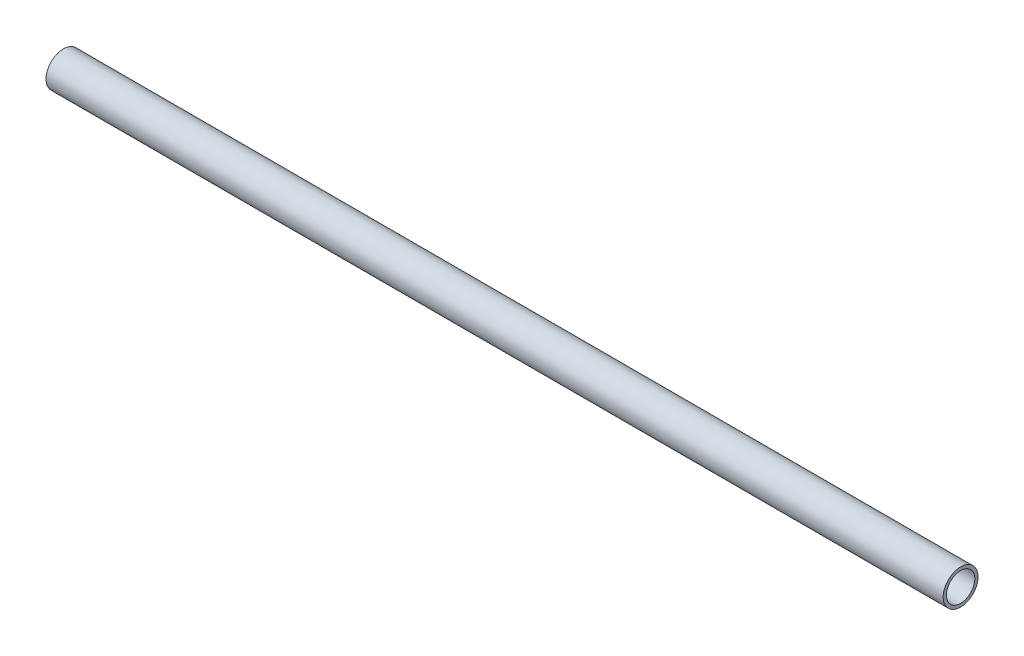
ISO-10303-21;
HEADER;
FILE_DESCRIPTION(('STEP AP214'),'2;1');
FILE_NAME('part.step','',(''),(''),'','','');
FILE_SCHEMA(('AUTOMOTIVE_DESIGN { 1 0 10303 214 1 1 1 1 }'));
ENDSEC;
DATA;
#1=APPLICATION_CONTEXT('core data for automotive mechanical design processes');
#2=APPLICATION_PROTOCOL_DEFINITION('international standard','automotive_design',2000,#1);
#3=PRODUCT_CONTEXT('',#1,'mechanical');
#4=PRODUCT('Part','Part','',(#3));
#5=PRODUCT_RELATED_PRODUCT_CATEGORY('part','',(#4));
#6=PRODUCT_DEFINITION_FORMATION('','',#4);
#7=PRODUCT_DEFINITION_CONTEXT('part definition',#1,'design');
#8=PRODUCT_DEFINITION('design','',#6,#7);
#9=PRODUCT_DEFINITION_SHAPE('','',#8);
#10=(LENGTH_UNIT() NAMED_UNIT(*) SI_UNIT(.MILLI.,.METRE.));
#11=(NAMED_UNIT(*) PLANE_ANGLE_UNIT() SI_UNIT($,.RADIAN.));
#12=(NAMED_UNIT(*) SI_UNIT($,.STERADIAN.) SOLID_ANGLE_UNIT());
#13=UNCERTAINTY_MEASURE_WITH_UNIT(LENGTH_MEASURE(1.E-05),#10,'distance_accuracy_value','');
#14=(GEOMETRIC_REPRESENTATION_CONTEXT(3) GLOBAL_UNCERTAINTY_ASSIGNED_CONTEXT((#13)) GLOBAL_UNIT_ASSIGNED_CONTEXT((#10,
#11,#12)) REPRESENTATION_CONTEXT('',''));
#15=CARTESIAN_POINT('',(0.,0.,0.));
#16=DIRECTION('',(0.,0.,1.));
#17=DIRECTION('',(1.,0.,0.));
#18=AXIS2_PLACEMENT_3D('',#15,#16,#17);
#19=CARTESIAN_POINT('',(496.930502708,7.874,0.));
#20=DIRECTION('',(-1.,0.,0.));
#21=DIRECTION('',(0.,0.,1.));
#22=AXIS2_PLACEMENT_3D('',#19,#20,#21);
#23=PLANE('',#22);
#24=CARTESIAN_POINT('',(496.930502708,0.,0.));
#25=DIRECTION('',(-1.,0.,0.));
#26=DIRECTION('',(0.,0.,1.));
#27=AXIS2_PLACEMENT_3D('',#24,#25,#26);
#28=CIRCLE('',#27,9.652);
#29=CARTESIAN_POINT('',(496.930502708,0.,9.652));
#30=VERTEX_POINT('',#29);
#31=EDGE_CURVE('E54',#30,#30,#28,.T.);
#32=ORIENTED_EDGE('',*,*,#31,.F.);
#33=EDGE_LOOP('',(#32));
#34=FACE_BOUND('',#33,.T.);
#35=CARTESIAN_POINT('',(496.930502708,0.,0.));
#36=DIRECTION('',(-1.,0.,0.));
#37=DIRECTION('',(0.,0.,1.));
#38=AXIS2_PLACEMENT_3D('',#35,#36,#37);
#39=CIRCLE('',#38,7.874);
#40=CARTESIAN_POINT('',(496.930502708,0.,7.874));
#41=VERTEX_POINT('',#40);
#42=EDGE_CURVE('E10',#41,#41,#39,.T.);
#43=ORIENTED_EDGE('',*,*,#42,.T.);
#44=EDGE_LOOP('',(#43));
#45=FACE_BOUND('',#44,.T.);
#46=ADVANCED_FACE('F37',(#34,#45),#23,.F.);
#47=CARTESIAN_POINT('',(0.,0.,0.));
#48=DIRECTION('',(-1.,0.,0.));
#49=DIRECTION('',(0.,0.,1.));
#50=AXIS2_PLACEMENT_3D('',#47,#48,#49);
#51=CYLINDRICAL_SURFACE('',#50,7.874);
#52=ORIENTED_EDGE('',*,*,#42,.F.);
#53=EDGE_LOOP('',(#52));
#54=FACE_BOUND('',#53,.T.);
#55=CARTESIAN_POINT('',(0.,0.,0.));
#56=DIRECTION('',(-1.,0.,0.));
#57=DIRECTION('',(0.,0.,1.));
#58=AXIS2_PLACEMENT_3D('',#55,#56,#57);
#59=CIRCLE('',#58,7.874);
#60=CARTESIAN_POINT('',(0.,0.,7.874));
#61=VERTEX_POINT('',#60);
#62=EDGE_CURVE('E44',#61,#61,#59,.T.);
#63=ORIENTED_EDGE('',*,*,#62,.T.);
#64=EDGE_LOOP('',(#63));
#65=FACE_BOUND('',#64,.T.);
#66=ADVANCED_FACE('F64',(#54,#65),#51,.F.);
#67=CARTESIAN_POINT('',(0.,7.874,0.));
#68=DIRECTION('',(1.,0.,0.));
#69=DIRECTION('',(0.,0.,-1.));
#70=AXIS2_PLACEMENT_3D('',#67,#68,#69);
#71=PLANE('',#70);
#72=ORIENTED_EDGE('',*,*,#62,.F.);
#73=EDGE_LOOP('',(#72));
#74=FACE_BOUND('',#73,.T.);
#75=CARTESIAN_POINT('',(0.,0.,0.));
#76=DIRECTION('',(-1.,0.,0.));
#77=DIRECTION('',(0.,0.,1.));
#78=AXIS2_PLACEMENT_3D('',#75,#76,#77);
#79=CIRCLE('',#78,9.652);
#80=CARTESIAN_POINT('',(0.,0.,9.652));
#81=VERTEX_POINT('',#80);
#82=EDGE_CURVE('E49',#81,#81,#79,.T.);
#83=ORIENTED_EDGE('',*,*,#82,.T.);
#84=EDGE_LOOP('',(#83));
#85=FACE_BOUND('',#84,.T.);
#86=ADVANCED_FACE('F68',(#74,#85),#71,.F.);
#87=CARTESIAN_POINT('',(0.,0.,0.));
#88=DIRECTION('',(-1.,0.,0.));
#89=DIRECTION('',(0.,0.,1.));
#90=AXIS2_PLACEMENT_3D('',#87,#88,#89);
#91=CYLINDRICAL_SURFACE('',#90,9.652);
#92=ORIENTED_EDGE('',*,*,#82,.F.);
#93=EDGE_LOOP('',(#92));
#94=FACE_BOUND('',#93,.T.);
#95=ORIENTED_EDGE('',*,*,#31,.T.);
#96=EDGE_LOOP('',(#95));
#97=FACE_BOUND('',#96,.T.);
#98=ADVANCED_FACE('F61',(#94,#97),#91,.T.);
#99=CLOSED_SHELL('',(#46,#66,#86,#98));
#100=MANIFOLD_SOLID_BREP('B2',#99);
#101=ADVANCED_BREP_SHAPE_REPRESENTATION('',(#18,#100),#14);
#102=SHAPE_DEFINITION_REPRESENTATION(#9,#101);
ENDSEC;
END-ISO-10303-21;
